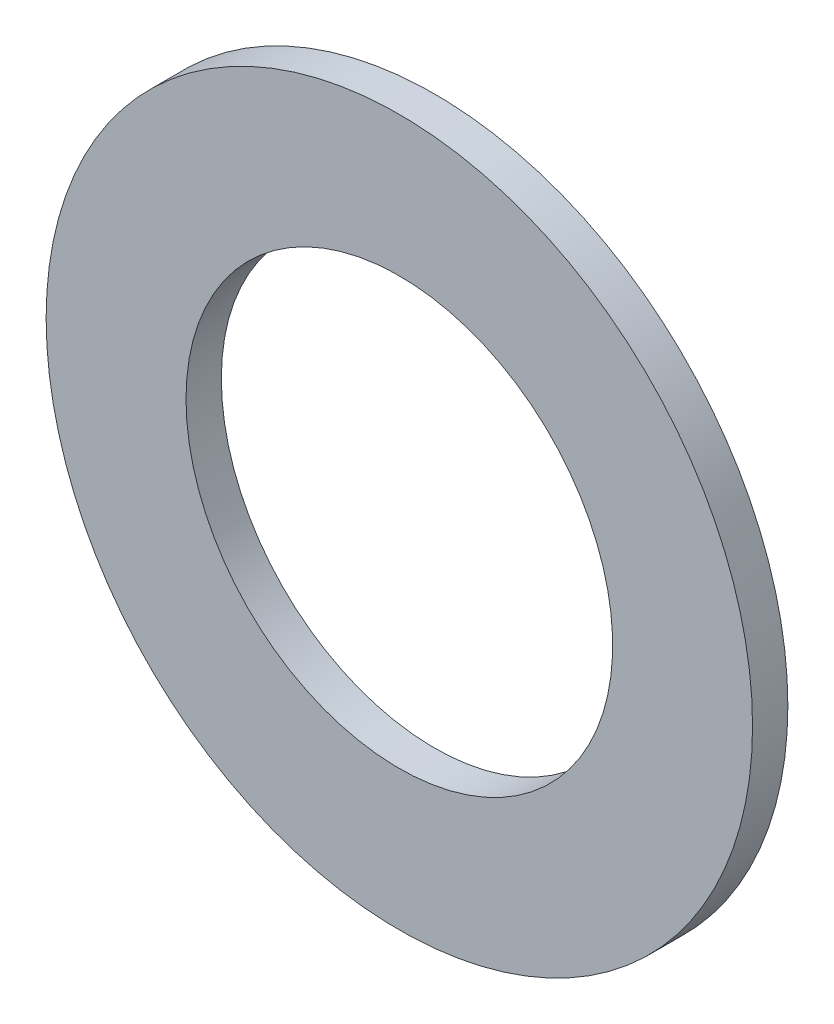
ISO-10303-21;
HEADER;
FILE_DESCRIPTION(('STEP AP214'),'2;1');
FILE_NAME('part.step','',(''),(''),'','','');
FILE_SCHEMA(('AUTOMOTIVE_DESIGN { 1 0 10303 214 1 1 1 1 }'));
ENDSEC;
DATA;
#1=APPLICATION_CONTEXT('core data for automotive mechanical design processes');
#2=APPLICATION_PROTOCOL_DEFINITION('international standard','automotive_design',2000,#1);
#3=PRODUCT_CONTEXT('',#1,'mechanical');
#4=PRODUCT('Part','Part','',(#3));
#5=PRODUCT_RELATED_PRODUCT_CATEGORY('part','',(#4));
#6=PRODUCT_DEFINITION_FORMATION('','',#4);
#7=PRODUCT_DEFINITION_CONTEXT('part definition',#1,'design');
#8=PRODUCT_DEFINITION('design','',#6,#7);
#9=PRODUCT_DEFINITION_SHAPE('','',#8);
#10=(LENGTH_UNIT() NAMED_UNIT(*) SI_UNIT(.MILLI.,.METRE.));
#11=(NAMED_UNIT(*) PLANE_ANGLE_UNIT() SI_UNIT($,.RADIAN.));
#12=(NAMED_UNIT(*) SI_UNIT($,.STERADIAN.) SOLID_ANGLE_UNIT());
#13=UNCERTAINTY_MEASURE_WITH_UNIT(LENGTH_MEASURE(1.E-05),#10,'distance_accuracy_value','');
#14=(GEOMETRIC_REPRESENTATION_CONTEXT(3) GLOBAL_UNCERTAINTY_ASSIGNED_CONTEXT((#13)) GLOBAL_UNIT_ASSIGNED_CONTEXT((#10,
#11,#12)) REPRESENTATION_CONTEXT('',''));
#15=CARTESIAN_POINT('',(0.,0.,0.));
#16=DIRECTION('',(0.,0.,1.));
#17=DIRECTION('',(1.,0.,0.));
#18=AXIS2_PLACEMENT_3D('',#15,#16,#17);
#19=CARTESIAN_POINT('',(0.,0.,0.79375));
#20=DIRECTION('',(0.,0.,-1.));
#21=DIRECTION('',(1.,0.,0.));
#22=AXIS2_PLACEMENT_3D('',#19,#20,#21);
#23=PLANE('',#22);
#24=CARTESIAN_POINT('',(0.,0.,0.79375));
#25=DIRECTION('',(0.,0.,-1.));
#26=DIRECTION('',(-1.,0.,0.));
#27=AXIS2_PLACEMENT_3D('',#24,#25,#26);
#28=CIRCLE('',#27,9.5885);
#29=CARTESIAN_POINT('',(-9.5885,0.,0.79375));
#30=VERTEX_POINT('',#29);
#31=EDGE_CURVE('E47',#30,#30,#28,.F.);
#32=ORIENTED_EDGE('',*,*,#31,.F.);
#33=EDGE_LOOP('',(#32));
#34=FACE_BOUND('',#33,.T.);
#35=CARTESIAN_POINT('',(0.,0.,0.79375));
#36=DIRECTION('',(0.,0.,-1.));
#37=DIRECTION('',(-1.,0.,0.));
#38=AXIS2_PLACEMENT_3D('',#35,#36,#37);
#39=CIRCLE('',#38,15.875);
#40=CARTESIAN_POINT('',(-15.875,0.,0.79375));
#41=VERTEX_POINT('',#40);
#42=EDGE_CURVE('E38',#41,#41,#39,.F.);
#43=ORIENTED_EDGE('',*,*,#42,.T.);
#44=EDGE_LOOP('',(#43));
#45=FACE_BOUND('',#44,.T.);
#46=ADVANCED_FACE('F35',(#34,#45),#23,.F.);
#47=CARTESIAN_POINT('',(0.,0.,-0.79375));
#48=DIRECTION('',(0.,0.,1.));
#49=DIRECTION('',(-1.,0.,0.));
#50=AXIS2_PLACEMENT_3D('',#47,#48,#49);
#51=CYLINDRICAL_SURFACE('',#50,15.875);
#52=ORIENTED_EDGE('',*,*,#42,.F.);
#53=EDGE_LOOP('',(#52));
#54=FACE_BOUND('',#53,.T.);
#55=CARTESIAN_POINT('',(0.,0.,-0.79375));
#56=DIRECTION('',(0.,0.,-1.));
#57=DIRECTION('',(-1.,0.,0.));
#58=AXIS2_PLACEMENT_3D('',#55,#56,#57);
#59=CIRCLE('',#58,15.875);
#60=CARTESIAN_POINT('',(-15.875,0.,-0.79375));
#61=VERTEX_POINT('',#60);
#62=EDGE_CURVE('E42',#61,#61,#59,.F.);
#63=ORIENTED_EDGE('',*,*,#62,.T.);
#64=EDGE_LOOP('',(#63));
#65=FACE_BOUND('',#64,.T.);
#66=ADVANCED_FACE('F56',(#54,#65),#51,.T.);
#67=CARTESIAN_POINT('',(0.,0.,-0.79375));
#68=DIRECTION('',(0.,0.,1.));
#69=DIRECTION('',(-1.,0.,0.));
#70=AXIS2_PLACEMENT_3D('',#67,#68,#69);
#71=CYLINDRICAL_SURFACE('',#70,9.5885);
#72=CARTESIAN_POINT('',(0.,0.,-0.79375));
#73=DIRECTION('',(0.,0.,-1.));
#74=DIRECTION('',(-1.,0.,0.));
#75=AXIS2_PLACEMENT_3D('',#72,#73,#74);
#76=CIRCLE('',#75,9.5885);
#77=CARTESIAN_POINT('',(-9.5885,0.,-0.79375));
#78=VERTEX_POINT('',#77);
#79=EDGE_CURVE('E10',#78,#78,#76,.T.);
#80=ORIENTED_EDGE('',*,*,#79,.T.);
#81=EDGE_LOOP('',(#80));
#82=FACE_BOUND('',#81,.T.);
#83=ORIENTED_EDGE('',*,*,#31,.T.);
#84=EDGE_LOOP('',(#83));
#85=FACE_BOUND('',#84,.T.);
#86=ADVANCED_FACE('F59',(#82,#85),#71,.F.);
#87=CARTESIAN_POINT('',(0.,0.,-0.79375));
#88=DIRECTION('',(0.,0.,-1.));
#89=DIRECTION('',(1.,0.,0.));
#90=AXIS2_PLACEMENT_3D('',#87,#88,#89);
#91=PLANE('',#90);
#92=ORIENTED_EDGE('',*,*,#79,.F.);
#93=EDGE_LOOP('',(#92));
#94=FACE_BOUND('',#93,.T.);
#95=ORIENTED_EDGE('',*,*,#62,.F.);
#96=EDGE_LOOP('',(#95));
#97=FACE_BOUND('',#96,.T.);
#98=ADVANCED_FACE('F62',(#94,#97),#91,.T.);
#99=CLOSED_SHELL('',(#46,#66,#86,#98));
#100=MANIFOLD_SOLID_BREP('B2',#99);
#101=ADVANCED_BREP_SHAPE_REPRESENTATION('',(#18,#100),#14);
#102=SHAPE_DEFINITION_REPRESENTATION(#9,#101);
ENDSEC;
END-ISO-10303-21;
